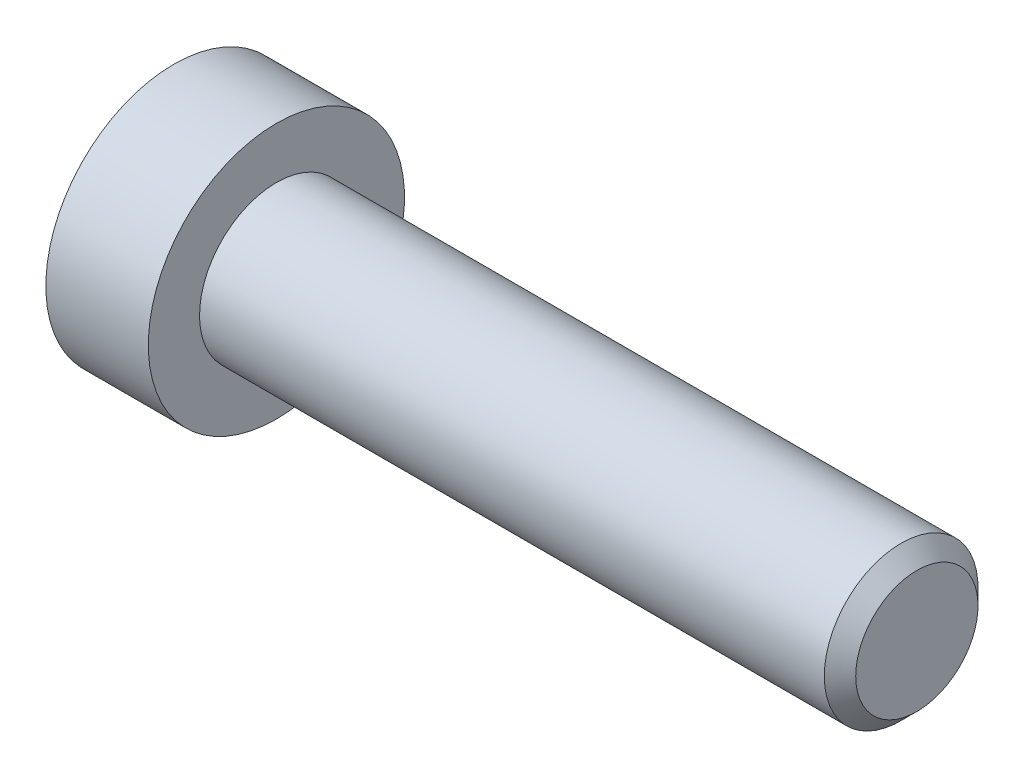
ISO-10303-21;
HEADER;
FILE_DESCRIPTION(('STEP AP214'),'2;1');
FILE_NAME('part.step','',(''),(''),'','','');
FILE_SCHEMA(('AUTOMOTIVE_DESIGN { 1 0 10303 214 1 1 1 1 }'));
ENDSEC;
DATA;
#1=APPLICATION_CONTEXT('core data for automotive mechanical design processes');
#2=APPLICATION_PROTOCOL_DEFINITION('international standard','automotive_design',2000,#1);
#3=PRODUCT_CONTEXT('',#1,'mechanical');
#4=PRODUCT('Part','Part','',(#3));
#5=PRODUCT_RELATED_PRODUCT_CATEGORY('part','',(#4));
#6=PRODUCT_DEFINITION_FORMATION('','',#4);
#7=PRODUCT_DEFINITION_CONTEXT('part definition',#1,'design');
#8=PRODUCT_DEFINITION('design','',#6,#7);
#9=PRODUCT_DEFINITION_SHAPE('','',#8);
#10=(LENGTH_UNIT() NAMED_UNIT(*) SI_UNIT(.MILLI.,.METRE.));
#11=(NAMED_UNIT(*) PLANE_ANGLE_UNIT() SI_UNIT($,.RADIAN.));
#12=(NAMED_UNIT(*) SI_UNIT($,.STERADIAN.) SOLID_ANGLE_UNIT());
#13=UNCERTAINTY_MEASURE_WITH_UNIT(LENGTH_MEASURE(1.E-05),#10,'distance_accuracy_value','');
#14=(GEOMETRIC_REPRESENTATION_CONTEXT(3) GLOBAL_UNCERTAINTY_ASSIGNED_CONTEXT((#13)) GLOBAL_UNIT_ASSIGNED_CONTEXT((#10,
#11,#12)) REPRESENTATION_CONTEXT('',''));
#15=CARTESIAN_POINT('',(0.,0.,0.));
#16=DIRECTION('',(0.,0.,1.));
#17=DIRECTION('',(1.,0.,0.));
#18=AXIS2_PLACEMENT_3D('',#15,#16,#17);
#19=CARTESIAN_POINT('',(0.999999999066858,0.,0.));
#20=DIRECTION('',(-1.,0.,0.));
#21=DIRECTION('',(0.,0.,1.));
#22=AXIS2_PLACEMENT_3D('',#19,#20,#21);
#23=CONICAL_SURFACE('',#22,1.49999999950978,1.04719755001518);
#24=CARTESIAN_POINT('',(1.86602540486547,1.13686837721616E-10,0.));
#25=VERTEX_POINT('',#24);
#26=VERTEX_LOOP('',#25);
#27=FACE_BOUND('',#26,.T.);
#28=CARTESIAN_POINT('',(1.,0.,0.));
#29=DIRECTION('',(1.,0.,0.));
#30=DIRECTION('',(0.,1.,0.));
#31=AXIS2_PLACEMENT_3D('',#28,#29,#30);
#32=CIRCLE('',#31,1.5);
#33=CARTESIAN_POINT('',(1.,1.5,0.));
#34=VERTEX_POINT('',#33);
#35=EDGE_CURVE('E102',#34,#34,#32,.F.);
#36=ORIENTED_EDGE('',*,*,#35,.T.);
#37=EDGE_LOOP('',(#36));
#38=FACE_BOUND('',#37,.T.);
#39=ADVANCED_FACE('F15',(#27,#38),#23,.F.);
#40=CARTESIAN_POINT('',(0.150320631441119,0.,0.));
#41=DIRECTION('',(1.,0.,0.));
#42=DIRECTION('',(0.,1.,0.));
#43=AXIS2_PLACEMENT_3D('',#40,#41,#42);
#44=CYLINDRICAL_SURFACE('',#43,1.5);
#45=ORIENTED_EDGE('',*,*,#35,.F.);
#46=EDGE_LOOP('',(#45));
#47=FACE_BOUND('',#46,.T.);
#48=CARTESIAN_POINT('',(-0.699358736312661,0.,0.));
#49=DIRECTION('',(-1.,0.,0.));
#50=DIRECTION('',(0.,1.,0.));
#51=AXIS2_PLACEMENT_3D('',#48,#49,#50);
#52=CIRCLE('',#51,1.50000000047612);
#53=CARTESIAN_POINT('',(-0.699358736312661,1.50000000047612,0.));
#54=VERTEX_POINT('',#53);
#55=EDGE_CURVE('E83',#54,#54,#52,.T.);
#56=ORIENTED_EDGE('',*,*,#55,.T.);
#57=EDGE_LOOP('',(#56));
#58=FACE_BOUND('',#57,.T.);
#59=ADVANCED_FACE('F152',(#47,#58),#44,.F.);
#60=CARTESIAN_POINT('',(-1.50480384832008,0.,0.));
#61=DIRECTION('',(-1.,0.,0.));
#62=DIRECTION('',(0.,0.,1.));
#63=AXIS2_PLACEMENT_3D('',#60,#61,#62);
#64=CONICAL_SURFACE('',#63,2.89507185334514,1.04719755001073);
#65=ORIENTED_EDGE('',*,*,#55,.F.);
#66=EDGE_LOOP('',(#65));
#67=FACE_BOUND('',#66,.T.);
#68=CARTESIAN_POINT('',(-1.50000000090994,2.50000000020726,1.44337567271138));
#69=CARTESIAN_POINT('',(-1.46336943230046,2.50000000007444,1.31652043381892));
#70=CARTESIAN_POINT('',(-1.4300558472106,2.50000000001995,1.18857018231563));
#71=CARTESIAN_POINT('',(-1.37190798495513,2.49999999998001,0.930454306290177));
#72=CARTESIAN_POINT('',(-1.34709427605387,2.49999999999471,0.800284097041287));
#73=CARTESIAN_POINT('',(-1.30846994921723,2.50000000000517,0.541556812697644));
#74=CARTESIAN_POINT('',(-1.29440223500533,2.50000000000138,0.413039534960997));
#75=CARTESIAN_POINT('',(-1.27761146065546,2.49999999999863,0.155400578725887));
#76=CARTESIAN_POINT('',(-1.27487449296861,2.49999999999966,0.0262798360324409));
#77=CARTESIAN_POINT('',(-1.28058286324248,2.5000000000003,-0.214968419856101));
#78=CARTESIAN_POINT('',(-1.28762660709737,2.50000000000009,-0.327132134317981));
#79=CARTESIAN_POINT('',(-1.30994662654135,2.49999999999992,-0.550728853225329));
#80=CARTESIAN_POINT('',(-1.32523051914313,2.49999999999998,-0.662161084886667));
#81=CARTESIAN_POINT('',(-1.36343729244334,2.50000000000003,-0.886218434121961));
#82=CARTESIAN_POINT('',(-1.38652205359365,2.50000000000002,-0.998815208519759));
#83=CARTESIAN_POINT('',(-1.43891470197747,2.49999999999999,-1.22232986213441));
#84=CARTESIAN_POINT('',(-1.46821028692561,2.49999999999998,-1.33325060262345));
#85=CARTESIAN_POINT('',(-1.50000000104471,2.5,-1.44337567270819));
#86=B_SPLINE_CURVE_WITH_KNOTS('',3,(#68,#69,#70,#71,#72,#73,#74,#75,#76,#77,#78,#79,#80,#81,#82,
#83,#84,#85),.UNSPECIFIED.,.F.,.F.,(4,2,2,2,2,2,2,2,4),(0.,0.39627001456981,0.793492271541644,
1.18088450803327,1.56780111154381,1.9046347285053,2.2417802422547,2.58640202794493,
2.93034746654568),.UNSPECIFIED.);
#87=CARTESIAN_POINT('',(-1.5000000010352,2.4999999998706,1.44337567289935));
#88=VERTEX_POINT('',#87);
#89=CARTESIAN_POINT('',(-1.50000000107833,2.5,-1.44337567282465));
#90=VERTEX_POINT('',#89);
#91=EDGE_CURVE('E18',#88,#90,#86,.T.);
#92=ORIENTED_EDGE('',*,*,#91,.T.);
#93=CARTESIAN_POINT('',(-1.50000000090994,2.49999999987614,-1.4433756732849));
#94=CARTESIAN_POINT('',(-1.46336943230046,2.39014014032572,-1.5068032926161));
#95=CARTESIAN_POINT('',(-1.4300558472106,2.27933197207602,-1.57077841832056));
#96=CARTESIAN_POINT('',(-1.37190798495513,2.05579706629793,-1.69983635629869));
#97=CARTESIAN_POINT('',(-1.34709427605387,1.9430663582798,-1.76492146093587));
#98=CARTESIAN_POINT('',(-1.30846994921723,1.71900195739128,-1.89428510311675));
#99=CARTESIAN_POINT('',(-1.29440223500533,1.60770273004423,-1.95854374198179));
#100=CARTESIAN_POINT('',(-1.27761146065546,1.38458084893874,-2.08736322009696));
#101=CARTESIAN_POINT('',(-1.27487449296861,1.27275900561122,-2.15192359144458));
#102=CARTESIAN_POINT('',(-1.28058286324248,1.06383188739337,-2.27254771938941));
#103=CARTESIAN_POINT('',(-1.28762660709736,0.966695261286451,-2.32862957662016));
#104=CARTESIAN_POINT('',(-1.30994662654135,0.773054822509758,-2.44042793607369));
#105=CARTESIAN_POINT('',(-1.32523051914313,0.676551679090675,-2.49614405190441));
#106=CARTESIAN_POINT('',(-1.36343729244334,0.482512322748331,-2.6081727265221));
#107=CARTESIAN_POINT('',(-1.38652205359365,0.385000655735647,-2.66447111372099));
#108=CARTESIAN_POINT('',(-1.43891470197746,0.191431287587271,-2.77622844052829));
#109=CARTESIAN_POINT('',(-1.4682102869256,0.095371108517176,-2.8316888107728));
#110=CARTESIAN_POINT('',(-1.50000000104471,2.30253922132991E-10,-2.88675134581519));
#111=B_SPLINE_CURVE_WITH_KNOTS('',3,(#93,#94,#95,#96,#97,#98,#99,#100,#101,#102,#103,#104,#105,
#106,#107,#108,#109,#110),.UNSPECIFIED.,.F.,.F.,(4,2,2,2,2,2,2,2,4),(0.,0.39627001456981,
0.793492271541645,1.18088450803327,1.56780111154381,1.9046347285053,2.2417802422547,
2.58640202794493,2.93034746654569),.UNSPECIFIED.);
#112=CARTESIAN_POINT('',(-1.5000000010352,0.,-2.88675134579871));
#113=VERTEX_POINT('',#112);
#114=EDGE_CURVE('E107',#90,#113,#111,.T.);
#115=ORIENTED_EDGE('',*,*,#114,.T.);
#116=CARTESIAN_POINT('',(-1.50000000090994,-3.3111445698491E-10,-2.88675134599628));
#117=CARTESIAN_POINT('',(-1.46336943230046,-0.109859859748714,-2.82332372643503));
#118=CARTESIAN_POINT('',(-1.4300558472106,-0.220668027943928,-2.75934860063619));
#119=CARTESIAN_POINT('',(-1.37190798495513,-0.444202933682073,-2.63029066258887));
#120=CARTESIAN_POINT('',(-1.34709427605387,-0.5569336417149,-2.56520555797716));
#121=CARTESIAN_POINT('',(-1.30846994921723,-0.780998042613884,-2.43584191581439));
#122=CARTESIAN_POINT('',(-1.29440223500533,-0.892297269957147,-2.37158327694279));
#123=CARTESIAN_POINT('',(-1.27761146065546,-1.11541915105988,-2.24276379882285));
#124=CARTESIAN_POINT('',(-1.27487449296861,-1.22724099438844,-2.17820342747702));
#125=CARTESIAN_POINT('',(-1.28058286324248,-1.43616811260693,-2.05757929953331));
#126=CARTESIAN_POINT('',(-1.28762660709736,-1.53330473871363,-2.00149744230218));
#127=CARTESIAN_POINT('',(-1.30994662654135,-1.72694517749016,-1.88969908284837));
#128=CARTESIAN_POINT('',(-1.32523051914313,-1.8234483209093,-1.83398296701775));
#129=CARTESIAN_POINT('',(-1.36343729244334,-2.01748767725169,-1.72195429240014));
#130=CARTESIAN_POINT('',(-1.38652205359365,-2.11499934426437,-1.66565590520123));
#131=CARTESIAN_POINT('',(-1.43891470197746,-2.30856871241272,-1.55389857839388));
#132=CARTESIAN_POINT('',(-1.4682102869256,-2.4046288914828,-1.49843820814935));
#133=CARTESIAN_POINT('',(-1.50000000104471,-2.49999999976975,-1.443375673107));
#134=B_SPLINE_CURVE_WITH_KNOTS('',3,(#116,#117,#118,#119,#120,#121,#122,#123,#124,#125,#126,
#127,#128,#129,#130,#131,#132,#133),.UNSPECIFIED.,.F.,.F.,(4,2,2,2,2,2,2,2,4),(0.,
0.396270014569809,0.793492271541644,1.18088450803327,1.56780111154381,1.9046347285053,
2.2417802422547,2.58640202794493,2.93034746654569),.UNSPECIFIED.);
#135=CARTESIAN_POINT('',(-1.5000000010352,-2.4999999998706,-1.44337567289936));
#136=VERTEX_POINT('',#135);
#137=EDGE_CURVE('E141',#113,#136,#134,.T.);
#138=ORIENTED_EDGE('',*,*,#137,.T.);
#139=CARTESIAN_POINT('',(-1.50000000090994,-2.50000000020726,-1.44337567271139));
#140=CARTESIAN_POINT('',(-1.46336943230046,-2.50000000007444,-1.31652043381893));
#141=CARTESIAN_POINT('',(-1.4300558472106,-2.50000000001995,-1.18857018231564));
#142=CARTESIAN_POINT('',(-1.37190798495513,-2.49999999998,-0.930454306290184));
#143=CARTESIAN_POINT('',(-1.34709427605387,-2.49999999999471,-0.800284097041294));
#144=CARTESIAN_POINT('',(-1.30846994921723,-2.50000000000516,-0.541556812697651));
#145=CARTESIAN_POINT('',(-1.29440223500533,-2.50000000000138,-0.413039534961004));
#146=CARTESIAN_POINT('',(-1.27761146065546,-2.49999999999863,-0.155400578725895));
#147=CARTESIAN_POINT('',(-1.27487449296861,-2.49999999999966,-0.0262798360324483));
#148=CARTESIAN_POINT('',(-1.28058286324248,-2.5000000000003,0.214968419856093));
#149=CARTESIAN_POINT('',(-1.28762660709736,-2.50000000000008,0.327132134317974));
#150=CARTESIAN_POINT('',(-1.30994662654135,-2.49999999999992,0.550728853225323));
#151=CARTESIAN_POINT('',(-1.32523051914313,-2.49999999999998,0.662161084886662));
#152=CARTESIAN_POINT('',(-1.36343729244334,-2.50000000000002,0.886218434121957));
#153=CARTESIAN_POINT('',(-1.38652205359365,-2.50000000000001,0.998815208519755));
#154=CARTESIAN_POINT('',(-1.43891470197746,-2.49999999999999,1.2223298621344));
#155=CARTESIAN_POINT('',(-1.4682102869256,-2.49999999999998,1.33325060262344));
#156=CARTESIAN_POINT('',(-1.50000000104471,-2.5,1.44337567270819));
#157=B_SPLINE_CURVE_WITH_KNOTS('',3,(#139,#140,#141,#142,#143,#144,#145,#146,#147,#148,#149,
#150,#151,#152,#153,#154,#155,#156),.UNSPECIFIED.,.F.,.F.,(4,2,2,2,2,2,2,2,4),(0.,
0.396270014569809,0.793492271541644,1.18088450803327,1.56780111154381,1.9046347285053,
2.2417802422547,2.58640202794493,2.93034746654569),.UNSPECIFIED.);
#158=CARTESIAN_POINT('',(-1.5000000010352,-2.4999999998706,1.44337567289936));
#159=VERTEX_POINT('',#158);
#160=EDGE_CURVE('E165',#136,#159,#157,.T.);
#161=ORIENTED_EDGE('',*,*,#160,.T.);
#162=CARTESIAN_POINT('',(-1.50000000090994,-2.49999999987614,1.44337567328489));
#163=CARTESIAN_POINT('',(-1.46336943230046,-2.39014014032572,1.5068032926161));
#164=CARTESIAN_POINT('',(-1.4300558472106,-2.27933197207602,1.57077841832055));
#165=CARTESIAN_POINT('',(-1.37190798495513,-2.05579706629793,1.69983635629869));
#166=CARTESIAN_POINT('',(-1.34709427605387,-1.9430663582798,1.76492146093586));
#167=CARTESIAN_POINT('',(-1.30846994921723,-1.71900195739128,1.89428510311674));
#168=CARTESIAN_POINT('',(-1.29440223500533,-1.60770273004423,1.95854374198179));
#169=CARTESIAN_POINT('',(-1.27761146065546,-1.38458084893874,2.08736322009696));
#170=CARTESIAN_POINT('',(-1.27487449296861,-1.27275900561122,2.15192359144457));
#171=CARTESIAN_POINT('',(-1.28058286324248,-1.06383188739337,2.2725477193894));
#172=CARTESIAN_POINT('',(-1.28762660709736,-0.966695261286452,2.32862957662015));
#173=CARTESIAN_POINT('',(-1.30994662654135,-0.773054822509759,2.44042793607369));
#174=CARTESIAN_POINT('',(-1.32523051914313,-0.676551679090675,2.49614405190441));
#175=CARTESIAN_POINT('',(-1.36343729244334,-0.482512322748331,2.6081727265221));
#176=CARTESIAN_POINT('',(-1.38652205359365,-0.385000655735646,2.66447111372098));
#177=CARTESIAN_POINT('',(-1.43891470197746,-0.19143128758727,2.77622844052829));
#178=CARTESIAN_POINT('',(-1.4682102869256,-0.0953711085171749,2.8316888107728));
#179=CARTESIAN_POINT('',(-1.50000000104471,-2.30252668835411E-10,2.88675134581519));
#180=B_SPLINE_CURVE_WITH_KNOTS('',3,(#162,#163,#164,#165,#166,#167,#168,#169,#170,#171,#172,
#173,#174,#175,#176,#177,#178,#179),.UNSPECIFIED.,.F.,.F.,(4,2,2,2,2,2,2,2,4),(0.,
0.396270014569809,0.793492271541644,1.18088450803327,1.56780111154381,1.9046347285053,
2.2417802422547,2.58640202794493,2.93034746654569),.UNSPECIFIED.);
#181=CARTESIAN_POINT('',(-1.5000000010352,0.,2.88675134579871));
#182=VERTEX_POINT('',#181);
#183=EDGE_CURVE('E88',#159,#182,#180,.T.);
#184=ORIENTED_EDGE('',*,*,#183,.T.);
#185=CARTESIAN_POINT('',(-1.50000000090994,3.31115352741516E-10,2.88675134599628));
#186=CARTESIAN_POINT('',(-1.46336943230046,0.109859859748716,2.82332372643503));
#187=CARTESIAN_POINT('',(-1.4300558472106,0.220668027943929,2.75934860063619));
#188=CARTESIAN_POINT('',(-1.37190798495513,0.444202933682074,2.63029066258887));
#189=CARTESIAN_POINT('',(-1.34709427605387,0.556933641714901,2.56520555797716));
#190=CARTESIAN_POINT('',(-1.30846994921723,0.780998042613885,2.43584191581439));
#191=CARTESIAN_POINT('',(-1.29440223500533,0.892297269957148,2.37158327694279));
#192=CARTESIAN_POINT('',(-1.27761146065546,1.11541915105988,2.24276379882285));
#193=CARTESIAN_POINT('',(-1.27487449296861,1.22724099438844,2.17820342747702));
#194=CARTESIAN_POINT('',(-1.28058286324248,1.43616811260693,2.05757929953331));
#195=CARTESIAN_POINT('',(-1.28762660709736,1.53330473871363,2.00149744230218));
#196=CARTESIAN_POINT('',(-1.30994662654135,1.72694517749016,1.88969908284836));
#197=CARTESIAN_POINT('',(-1.32523051914313,1.8234483209093,1.83398296701774));
#198=CARTESIAN_POINT('',(-1.36343729244334,2.01748767725169,1.72195429240013));
#199=CARTESIAN_POINT('',(-1.38652205359365,2.11499934426437,1.66565590520122));
#200=CARTESIAN_POINT('',(-1.43891470197746,2.30856871241272,1.55389857839388));
#201=CARTESIAN_POINT('',(-1.4682102869256,2.40462889148281,1.49843820814935));
#202=CARTESIAN_POINT('',(-1.50000000104471,2.49999999976975,1.44337567310699));
#203=B_SPLINE_CURVE_WITH_KNOTS('',3,(#185,#186,#187,#188,#189,#190,#191,#192,#193,#194,#195,
#196,#197,#198,#199,#200,#201,#202),.UNSPECIFIED.,.F.,.F.,(4,2,2,2,2,2,2,2,4),(0.,
0.39627001456981,0.793492271541644,1.18088450803327,1.56780111154381,1.9046347285053,
2.2417802422547,2.58640202794494,2.9303474665457),.UNSPECIFIED.);
#204=EDGE_CURVE('E85',#182,#88,#203,.T.);
#205=ORIENTED_EDGE('',*,*,#204,.T.);
#206=EDGE_LOOP('',(#92,#115,#138,#161,#184,#205));
#207=FACE_BOUND('',#206,.T.);
#208=ADVANCED_FACE('F86',(#67,#207),#64,.F.);
#209=CARTESIAN_POINT('',(-3.99999999999999,2.5,1.44337567297406));
#210=DIRECTION('',(0.,1.,0.));
#211=DIRECTION('',(0.,0.,1.));
#212=AXIS2_PLACEMENT_3D('',#209,#210,#211);
#213=PLANE('',#212);
#214=DIRECTION('',(1.,0.,0.));
#215=VECTOR('',#214,1.);
#216=CARTESIAN_POINT('',(-3.99999999999999,2.5,1.44337567297406));
#217=LINE('',#216,#215);
#218=CARTESIAN_POINT('',(-3.99999999999999,2.5,1.44337567297406));
#219=VERTEX_POINT('',#218);
#220=EDGE_CURVE('E76',#88,#219,#217,.F.);
#221=ORIENTED_EDGE('',*,*,#220,.T.);
#222=DIRECTION('',(0.,0.,1.));
#223=VECTOR('',#222,1.);
#224=CARTESIAN_POINT('',(-3.99999999999999,2.5,0.));
#225=LINE('',#224,#223);
#226=CARTESIAN_POINT('',(-3.99999999999999,2.5,-1.44337567297407));
#227=VERTEX_POINT('',#226);
#228=EDGE_CURVE('E105',#227,#219,#225,.T.);
#229=ORIENTED_EDGE('',*,*,#228,.F.);
#230=DIRECTION('',(1.,0.,0.));
#231=VECTOR('',#230,1.);
#232=CARTESIAN_POINT('',(-3.99999999999999,2.5,-1.44337567297407));
#233=LINE('',#232,#231);
#234=EDGE_CURVE('E79',#227,#90,#233,.T.);
#235=ORIENTED_EDGE('',*,*,#234,.T.);
#236=ORIENTED_EDGE('',*,*,#91,.F.);
#237=EDGE_LOOP('',(#221,#229,#235,#236));
#238=FACE_BOUND('',#237,.T.);
#239=ADVANCED_FACE('F73',(#238),#213,.F.);
#240=CARTESIAN_POINT('',(-3.99999999999999,0.,2.88675134594813));
#241=DIRECTION('',(0.,0.500000000000001,0.866025403784438));
#242=DIRECTION('',(0.,-0.866025403784438,0.500000000000001));
#243=AXIS2_PLACEMENT_3D('',#240,#241,#242);
#244=PLANE('',#243);
#245=DIRECTION('',(1.,0.,0.));
#246=VECTOR('',#245,1.);
#247=CARTESIAN_POINT('',(-3.99999999999999,0.,2.88675134594813));
#248=LINE('',#247,#246);
#249=CARTESIAN_POINT('',(-3.99999999999999,0.,2.88675134594813));
#250=VERTEX_POINT('',#249);
#251=EDGE_CURVE('E91',#182,#250,#248,.F.);
#252=ORIENTED_EDGE('',*,*,#251,.T.);
#253=DIRECTION('',(0.,-0.866025403784438,0.500000000000001));
#254=VECTOR('',#253,1.);
#255=CARTESIAN_POINT('',(-3.99999999999999,2.5,1.44337567297406));
#256=LINE('',#255,#254);
#257=EDGE_CURVE('E94',#219,#250,#256,.T.);
#258=ORIENTED_EDGE('',*,*,#257,.F.);
#259=ORIENTED_EDGE('',*,*,#220,.F.);
#260=ORIENTED_EDGE('',*,*,#204,.F.);
#261=EDGE_LOOP('',(#252,#258,#259,#260));
#262=FACE_BOUND('',#261,.T.);
#263=ADVANCED_FACE('F92',(#262),#244,.F.);
#264=CARTESIAN_POINT('',(-3.99999999999999,-2.5,1.44337567297406));
#265=DIRECTION('',(0.,-0.5,0.866025403784439));
#266=DIRECTION('',(0.,-0.866025403784439,-0.5));
#267=AXIS2_PLACEMENT_3D('',#264,#265,#266);
#268=PLANE('',#267);
#269=DIRECTION('',(1.,0.,0.));
#270=VECTOR('',#269,1.);
#271=CARTESIAN_POINT('',(-3.99999999999999,-2.5,1.44337567297406));
#272=LINE('',#271,#270);
#273=CARTESIAN_POINT('',(-3.99999999999999,-2.5,1.44337567297407));
#274=VERTEX_POINT('',#273);
#275=EDGE_CURVE('E174',#159,#274,#272,.F.);
#276=ORIENTED_EDGE('',*,*,#275,.T.);
#277=DIRECTION('',(0.,-0.866025403784439,-0.5));
#278=VECTOR('',#277,1.);
#279=CARTESIAN_POINT('',(-3.99999999999999,0.,2.88675134594813));
#280=LINE('',#279,#278);
#281=EDGE_CURVE('E118',#250,#274,#280,.T.);
#282=ORIENTED_EDGE('',*,*,#281,.F.);
#283=ORIENTED_EDGE('',*,*,#251,.F.);
#284=ORIENTED_EDGE('',*,*,#183,.F.);
#285=EDGE_LOOP('',(#276,#282,#283,#284));
#286=FACE_BOUND('',#285,.T.);
#287=ADVANCED_FACE('F175',(#286),#268,.F.);
#288=CARTESIAN_POINT('',(-3.99999999999999,-2.5,-1.44337567297406));
#289=DIRECTION('',(0.,-1.,0.));
#290=DIRECTION('',(0.,0.,-1.));
#291=AXIS2_PLACEMENT_3D('',#288,#289,#290);
#292=PLANE('',#291);
#293=DIRECTION('',(1.,0.,0.));
#294=VECTOR('',#293,1.);
#295=CARTESIAN_POINT('',(-3.99999999999999,-2.5,-1.44337567297406));
#296=LINE('',#295,#294);
#297=CARTESIAN_POINT('',(-3.99999999999999,-2.5,-1.44337567297406));
#298=VERTEX_POINT('',#297);
#299=EDGE_CURVE('E226',#136,#298,#296,.F.);
#300=ORIENTED_EDGE('',*,*,#299,.T.);
#301=DIRECTION('',(0.,0.,1.));
#302=VECTOR('',#301,1.);
#303=CARTESIAN_POINT('',(-3.99999999999999,-2.5,0.));
#304=LINE('',#303,#302);
#305=EDGE_CURVE('E115',#274,#298,#304,.F.);
#306=ORIENTED_EDGE('',*,*,#305,.F.);
#307=ORIENTED_EDGE('',*,*,#275,.F.);
#308=ORIENTED_EDGE('',*,*,#160,.F.);
#309=EDGE_LOOP('',(#300,#306,#307,#308));
#310=FACE_BOUND('',#309,.T.);
#311=ADVANCED_FACE('F178',(#310),#292,.F.);
#312=CARTESIAN_POINT('',(-3.99999999999999,0.,-2.88675134594813));
#313=DIRECTION('',(0.,-0.5,-0.866025403784439));
#314=DIRECTION('',(0.,0.866025403784439,-0.5));
#315=AXIS2_PLACEMENT_3D('',#312,#313,#314);
#316=PLANE('',#315);
#317=DIRECTION('',(1.,0.,0.));
#318=VECTOR('',#317,1.);
#319=CARTESIAN_POINT('',(-3.99999999999999,0.,-2.88675134594813));
#320=LINE('',#319,#318);
#321=CARTESIAN_POINT('',(-3.99999999999999,0.,-2.88675134594813));
#322=VERTEX_POINT('',#321);
#323=EDGE_CURVE('E38',#113,#322,#320,.F.);
#324=ORIENTED_EDGE('',*,*,#323,.T.);
#325=DIRECTION('',(0.,0.866025403784439,-0.5));
#326=VECTOR('',#325,1.);
#327=CARTESIAN_POINT('',(-3.99999999999999,-2.5,-1.44337567297406));
#328=LINE('',#327,#326);
#329=EDGE_CURVE('E112',#298,#322,#328,.T.);
#330=ORIENTED_EDGE('',*,*,#329,.F.);
#331=ORIENTED_EDGE('',*,*,#299,.F.);
#332=ORIENTED_EDGE('',*,*,#137,.F.);
#333=EDGE_LOOP('',(#324,#330,#331,#332));
#334=FACE_BOUND('',#333,.T.);
#335=ADVANCED_FACE('F217',(#334),#316,.F.);
#336=CARTESIAN_POINT('',(-3.99999999999999,2.5,-1.44337567297407));
#337=DIRECTION('',(0.,0.5,-0.866025403784439));
#338=DIRECTION('',(0.,0.866025403784439,0.5));
#339=AXIS2_PLACEMENT_3D('',#336,#337,#338);
#340=PLANE('',#339);
#341=ORIENTED_EDGE('',*,*,#234,.F.);
#342=DIRECTION('',(0.,0.866025403784439,0.5));
#343=VECTOR('',#342,1.);
#344=CARTESIAN_POINT('',(-3.99999999999999,0.,-2.88675134594813));
#345=LINE('',#344,#343);
#346=EDGE_CURVE('E108',#322,#227,#345,.T.);
#347=ORIENTED_EDGE('',*,*,#346,.F.);
#348=ORIENTED_EDGE('',*,*,#323,.F.);
#349=ORIENTED_EDGE('',*,*,#114,.F.);
#350=EDGE_LOOP('',(#341,#347,#348,#349));
#351=FACE_BOUND('',#350,.T.);
#352=ADVANCED_FACE('F147',(#351),#340,.F.);
#353=CARTESIAN_POINT('',(-3.99999999999999,3.94337567297406,0.));
#354=DIRECTION('',(-1.,0.,0.));
#355=DIRECTION('',(0.,0.,1.));
#356=AXIS2_PLACEMENT_3D('',#353,#354,#355);
#357=PLANE('',#356);
#358=ORIENTED_EDGE('',*,*,#329,.T.);
#359=ORIENTED_EDGE('',*,*,#346,.T.);
#360=ORIENTED_EDGE('',*,*,#228,.T.);
#361=ORIENTED_EDGE('',*,*,#257,.T.);
#362=ORIENTED_EDGE('',*,*,#281,.T.);
#363=ORIENTED_EDGE('',*,*,#305,.T.);
#364=EDGE_LOOP('',(#358,#359,#360,#361,#362,#363));
#365=FACE_BOUND('',#364,.T.);
#366=CARTESIAN_POINT('',(-3.99999999999999,0.,0.));
#367=DIRECTION('',(1.,0.,0.));
#368=DIRECTION('',(0.,1.,0.));
#369=AXIS2_PLACEMENT_3D('',#366,#367,#368);
#370=CIRCLE('',#369,5.);
#371=CARTESIAN_POINT('',(-3.99999999999999,5.,0.));
#372=VERTEX_POINT('',#371);
#373=EDGE_CURVE('E111',#372,#372,#370,.T.);
#374=ORIENTED_EDGE('',*,*,#373,.F.);
#375=EDGE_LOOP('',(#374));
#376=FACE_BOUND('',#375,.T.);
#377=ADVANCED_FACE('F210',(#365,#376),#357,.T.);
#378=CARTESIAN_POINT('',(-2.,0.,0.));
#379=DIRECTION('',(1.,0.,0.));
#380=DIRECTION('',(0.,1.,0.));
#381=AXIS2_PLACEMENT_3D('',#378,#379,#380);
#382=CYLINDRICAL_SURFACE('',#381,5.);
#383=ORIENTED_EDGE('',*,*,#373,.T.);
#384=EDGE_LOOP('',(#383));
#385=FACE_BOUND('',#384,.T.);
#386=CARTESIAN_POINT('',(0.,0.,0.));
#387=DIRECTION('',(1.,0.,0.));
#388=DIRECTION('',(0.,1.,0.));
#389=AXIS2_PLACEMENT_3D('',#386,#387,#388);
#390=CIRCLE('',#389,5.);
#391=CARTESIAN_POINT('',(0.,5.,0.));
#392=VERTEX_POINT('',#391);
#393=EDGE_CURVE('E131',#392,#392,#390,.T.);
#394=ORIENTED_EDGE('',*,*,#393,.F.);
#395=EDGE_LOOP('',(#394));
#396=FACE_BOUND('',#395,.T.);
#397=ADVANCED_FACE('F207',(#385,#396),#382,.T.);
#398=CARTESIAN_POINT('',(25.,1.5,0.));
#399=DIRECTION('',(1.,0.,0.));
#400=DIRECTION('',(0.,0.,-1.));
#401=AXIS2_PLACEMENT_3D('',#398,#399,#400);
#402=PLANE('',#401);
#403=CARTESIAN_POINT('',(25.0000000003183,0.,0.));
#404=DIRECTION('',(-1.,0.,0.));
#405=DIRECTION('',(0.,0.,1.));
#406=AXIS2_PLACEMENT_3D('',#403,#404,#405);
#407=CIRCLE('',#406,2.38655000021026);
#408=CARTESIAN_POINT('',(25.0000000003183,0.,2.38655000021026));
#409=VERTEX_POINT('',#408);
#410=EDGE_CURVE('E128',#409,#409,#407,.T.);
#411=ORIENTED_EDGE('',*,*,#410,.F.);
#412=EDGE_LOOP('',(#411));
#413=FACE_BOUND('',#412,.T.);
#414=ADVANCED_FACE('F203',(#413),#402,.T.);
#415=CARTESIAN_POINT('',(0.,4.,0.));
#416=DIRECTION('',(1.,0.,0.));
#417=DIRECTION('',(0.,0.,-1.));
#418=AXIS2_PLACEMENT_3D('',#415,#416,#417);
#419=PLANE('',#418);
#420=CARTESIAN_POINT('',(0.,0.,0.));
#421=DIRECTION('',(1.,0.,0.));
#422=DIRECTION('',(0.,1.,0.));
#423=AXIS2_PLACEMENT_3D('',#420,#421,#422);
#424=CIRCLE('',#423,3.);
#425=CARTESIAN_POINT('',(0.,3.,0.));
#426=VERTEX_POINT('',#425);
#427=EDGE_CURVE('E29',#426,#426,#424,.T.);
#428=ORIENTED_EDGE('',*,*,#427,.F.);
#429=EDGE_LOOP('',(#428));
#430=FACE_BOUND('',#429,.T.);
#431=ORIENTED_EDGE('',*,*,#393,.T.);
#432=EDGE_LOOP('',(#431));
#433=FACE_BOUND('',#432,.T.);
#434=ADVANCED_FACE('F196',(#430,#433),#419,.T.);
#435=CARTESIAN_POINT('',(24.3865499997469,0.,0.));
#436=DIRECTION('',(-1.,0.,0.));
#437=DIRECTION('',(0.,0.,1.));
#438=AXIS2_PLACEMENT_3D('',#435,#436,#437);
#439=CONICAL_SURFACE('',#438,2.99999999970169,0.785398162517161);
#440=ORIENTED_EDGE('',*,*,#410,.T.);
#441=EDGE_LOOP('',(#440));
#442=FACE_BOUND('',#441,.T.);
#443=CARTESIAN_POINT('',(24.38655,0.,0.));
#444=DIRECTION('',(1.,0.,0.));
#445=DIRECTION('',(0.,1.,0.));
#446=AXIS2_PLACEMENT_3D('',#443,#444,#445);
#447=CIRCLE('',#446,3.);
#448=CARTESIAN_POINT('',(24.38655,3.,0.));
#449=VERTEX_POINT('',#448);
#450=EDGE_CURVE('E9',#449,#449,#447,.F.);
#451=ORIENTED_EDGE('',*,*,#450,.F.);
#452=EDGE_LOOP('',(#451));
#453=FACE_BOUND('',#452,.T.);
#454=ADVANCED_FACE('F189',(#442,#453),#439,.T.);
#455=CARTESIAN_POINT('',(12.5,0.,0.));
#456=DIRECTION('',(1.,0.,0.));
#457=DIRECTION('',(0.,1.,0.));
#458=AXIS2_PLACEMENT_3D('',#455,#456,#457);
#459=CYLINDRICAL_SURFACE('',#458,3.);
#460=ORIENTED_EDGE('',*,*,#450,.T.);
#461=EDGE_LOOP('',(#460));
#462=FACE_BOUND('',#461,.T.);
#463=ORIENTED_EDGE('',*,*,#427,.T.);
#464=EDGE_LOOP('',(#463));
#465=FACE_BOUND('',#464,.T.);
#466=ADVANCED_FACE('F187',(#462,#465),#459,.T.);
#467=CLOSED_SHELL('',(#39,#59,#208,#239,#263,#287,#311,#335,#352,#377,#397,#414,#434,#454,#466));
#468=MANIFOLD_SOLID_BREP('B1',#467);
#469=ADVANCED_BREP_SHAPE_REPRESENTATION('',(#18,#468),#14);
#470=SHAPE_DEFINITION_REPRESENTATION(#9,#469);
ENDSEC;
END-ISO-10303-21;
